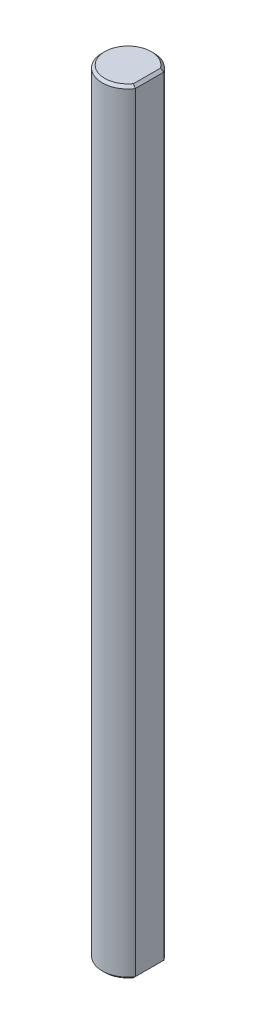
ISO-10303-21;
HEADER;
FILE_DESCRIPTION(('STEP AP214'),'2;1');
FILE_NAME('part.step','',(''),(''),'','','');
FILE_SCHEMA(('AUTOMOTIVE_DESIGN { 1 0 10303 214 1 1 1 1 }'));
ENDSEC;
DATA;
#1=APPLICATION_CONTEXT('core data for automotive mechanical design processes');
#2=APPLICATION_PROTOCOL_DEFINITION('international standard','automotive_design',2000,#1);
#3=PRODUCT_CONTEXT('',#1,'mechanical');
#4=PRODUCT('Part','Part','',(#3));
#5=PRODUCT_RELATED_PRODUCT_CATEGORY('part','',(#4));
#6=PRODUCT_DEFINITION_FORMATION('','',#4);
#7=PRODUCT_DEFINITION_CONTEXT('part definition',#1,'design');
#8=PRODUCT_DEFINITION('design','',#6,#7);
#9=PRODUCT_DEFINITION_SHAPE('','',#8);
#10=(LENGTH_UNIT() NAMED_UNIT(*) SI_UNIT(.MILLI.,.METRE.));
#11=(NAMED_UNIT(*) PLANE_ANGLE_UNIT() SI_UNIT($,.RADIAN.));
#12=(NAMED_UNIT(*) SI_UNIT($,.STERADIAN.) SOLID_ANGLE_UNIT());
#13=UNCERTAINTY_MEASURE_WITH_UNIT(LENGTH_MEASURE(1.E-05),#10,'distance_accuracy_value','');
#14=(GEOMETRIC_REPRESENTATION_CONTEXT(3) GLOBAL_UNCERTAINTY_ASSIGNED_CONTEXT((#13)) GLOBAL_UNIT_ASSIGNED_CONTEXT((#10,
#11,#12)) REPRESENTATION_CONTEXT('',''));
#15=CARTESIAN_POINT('',(0.,0.,0.));
#16=DIRECTION('',(0.,0.,1.));
#17=DIRECTION('',(1.,0.,0.));
#18=AXIS2_PLACEMENT_3D('',#15,#16,#17);
#19=CARTESIAN_POINT('',(0.,90.,0.));
#20=DIRECTION('',(0.,-1.,0.));
#21=DIRECTION('',(0.,0.,-1.));
#22=AXIS2_PLACEMENT_3D('',#19,#20,#21);
#23=CYLINDRICAL_SURFACE('',#22,3.);
#24=DIRECTION('',(0.,-1.,0.));
#25=VECTOR('',#24,1.);
#26=CARTESIAN_POINT('',(2.5,90.,-1.6583123951777));
#27=LINE('',#26,#25);
#28=CARTESIAN_POINT('',(2.5,89.7000000000001,-1.6583123951777));
#29=VERTEX_POINT('',#28);
#30=CARTESIAN_POINT('',(2.5,0.300000000000078,-1.6583123951777));
#31=VERTEX_POINT('',#30);
#32=EDGE_CURVE('E88',#29,#31,#27,.T.);
#33=ORIENTED_EDGE('',*,*,#32,.T.);
#34=CARTESIAN_POINT('',(0.,0.300000000000064,0.));
#35=DIRECTION('',(0.,1.,0.));
#36=DIRECTION('',(0.,0.,1.));
#37=AXIS2_PLACEMENT_3D('',#34,#35,#36);
#38=CIRCLE('',#37,3.);
#39=CARTESIAN_POINT('',(2.5,0.300000000000078,1.6583123951777));
#40=VERTEX_POINT('',#39);
#41=EDGE_CURVE('E93',#31,#40,#38,.T.);
#42=ORIENTED_EDGE('',*,*,#41,.T.);
#43=DIRECTION('',(0.,-1.,0.));
#44=VECTOR('',#43,1.);
#45=CARTESIAN_POINT('',(2.5,90.,1.6583123951777));
#46=LINE('',#45,#44);
#47=CARTESIAN_POINT('',(2.5,89.7000000000001,1.6583123951777));
#48=VERTEX_POINT('',#47);
#49=EDGE_CURVE('E90',#48,#40,#46,.T.);
#50=ORIENTED_EDGE('',*,*,#49,.F.);
#51=CARTESIAN_POINT('',(0.,89.7000000000001,0.));
#52=DIRECTION('',(0.,1.,0.));
#53=DIRECTION('',(0.,0.,1.));
#54=AXIS2_PLACEMENT_3D('',#51,#52,#53);
#55=CIRCLE('',#54,3.);
#56=EDGE_CURVE('E86',#48,#29,#55,.F.);
#57=ORIENTED_EDGE('',*,*,#56,.T.);
#58=EDGE_LOOP('',(#33,#42,#50,#57));
#59=FACE_BOUND('',#58,.T.);
#60=ADVANCED_FACE('F36',(#59),#23,.T.);
#61=CARTESIAN_POINT('',(2.5,90.,-1.6583123951777));
#62=DIRECTION('',(-1.,0.,0.));
#63=DIRECTION('',(0.,0.,1.));
#64=AXIS2_PLACEMENT_3D('',#61,#62,#63);
#65=PLANE('',#64);
#66=ORIENTED_EDGE('',*,*,#49,.T.);
#67=DIRECTION('',(0.,0.,-1.));
#68=VECTOR('',#67,1.);
#69=CARTESIAN_POINT('',(2.5,0.30000000000005,-1.6583123951777));
#70=LINE('',#69,#68);
#71=EDGE_CURVE('E101',#40,#31,#70,.T.);
#72=ORIENTED_EDGE('',*,*,#71,.T.);
#73=ORIENTED_EDGE('',*,*,#32,.F.);
#74=DIRECTION('',(0.,0.,1.));
#75=VECTOR('',#74,1.);
#76=CARTESIAN_POINT('',(2.5,89.7000000000001,1.6583123951777));
#77=LINE('',#76,#75);
#78=EDGE_CURVE('E99',#29,#48,#77,.T.);
#79=ORIENTED_EDGE('',*,*,#78,.T.);
#80=EDGE_LOOP('',(#66,#72,#73,#79));
#81=FACE_BOUND('',#80,.T.);
#82=ADVANCED_FACE('F98',(#81),#65,.F.);
#83=CARTESIAN_POINT('',(0.,90.,0.));
#84=DIRECTION('',(0.,1.,0.));
#85=DIRECTION('',(0.,0.,1.));
#86=AXIS2_PLACEMENT_3D('',#83,#84,#85);
#87=PLANE('',#86);
#88=CARTESIAN_POINT('',(0.,90.,0.));
#89=DIRECTION('',(0.,1.,0.));
#90=DIRECTION('',(0.,0.,1.));
#91=AXIS2_PLACEMENT_3D('',#88,#89,#90);
#92=CIRCLE('',#91,2.70000000000005);
#93=CARTESIAN_POINT('',(2.19999999999984,90.,-1.56524758425016));
#94=VERTEX_POINT('',#93);
#95=CARTESIAN_POINT('',(2.19999999999984,90.,1.56524758425016));
#96=VERTEX_POINT('',#95);
#97=EDGE_CURVE('E51',#94,#96,#92,.T.);
#98=ORIENTED_EDGE('',*,*,#97,.T.);
#99=DIRECTION('',(0.,0.,-1.));
#100=VECTOR('',#99,1.);
#101=CARTESIAN_POINT('',(2.20000000000005,90.,-1.6583123951777));
#102=LINE('',#101,#100);
#103=EDGE_CURVE('E11',#96,#94,#102,.T.);
#104=ORIENTED_EDGE('',*,*,#103,.T.);
#105=EDGE_LOOP('',(#98,#104));
#106=FACE_BOUND('',#105,.T.);
#107=ADVANCED_FACE('F158',(#106),#87,.T.);
#108=CARTESIAN_POINT('',(0.,0.,0.));
#109=DIRECTION('',(0.,1.,0.));
#110=DIRECTION('',(0.,0.,1.));
#111=AXIS2_PLACEMENT_3D('',#108,#109,#110);
#112=PLANE('',#111);
#113=CARTESIAN_POINT('',(0.,0.,0.));
#114=DIRECTION('',(0.,1.,0.));
#115=DIRECTION('',(0.,0.,1.));
#116=AXIS2_PLACEMENT_3D('',#113,#114,#115);
#117=CIRCLE('',#116,2.69999999999995);
#118=CARTESIAN_POINT('',(2.19999999999974,0.,1.56524758425013));
#119=VERTEX_POINT('',#118);
#120=CARTESIAN_POINT('',(2.19999999999974,0.,-1.56524758425013));
#121=VERTEX_POINT('',#120);
#122=EDGE_CURVE('E146',#119,#121,#117,.F.);
#123=ORIENTED_EDGE('',*,*,#122,.T.);
#124=DIRECTION('',(0.,0.,1.));
#125=VECTOR('',#124,1.);
#126=CARTESIAN_POINT('',(2.19999999999995,0.,0.));
#127=LINE('',#126,#125);
#128=EDGE_CURVE('E94',#121,#119,#127,.T.);
#129=ORIENTED_EDGE('',*,*,#128,.T.);
#130=EDGE_LOOP('',(#123,#129));
#131=FACE_BOUND('',#130,.T.);
#132=ADVANCED_FACE('F156',(#131),#112,.F.);
#133=CARTESIAN_POINT('',(0.,0.30000000000005,0.));
#134=DIRECTION('',(0.,1.,0.));
#135=DIRECTION('',(0.,0.,1.));
#136=AXIS2_PLACEMENT_3D('',#133,#134,#135);
#137=CONICAL_SURFACE('',#136,3.,0.785398163397444);
#138=CARTESIAN_POINT('',(2.5,0.30000000000005,-1.6583123951777));
#139=CARTESIAN_POINT('',(2.44993376791129,0.249933767911336,-1.64322876187384));
#140=CARTESIAN_POINT('',(2.39990066385969,0.199900663859741,-1.62793154813919));
#141=CARTESIAN_POINT('',(2.29990066379602,0.0999006637960638,-1.59690994490714));
#142=CARTESIAN_POINT('',(2.24993376784759,0.0499337678476331,-1.58118555499938));
#143=CARTESIAN_POINT('',(2.19999999999993,0.,-1.56524758425045));
#144=B_SPLINE_CURVE_WITH_KNOTS('',3,(#138,#139,#140,#141,#142,#143),.UNSPECIFIED.,.F.,.F.,(4,2,
4),(0.,0.217176540517321,0.434353289675063),.UNSPECIFIED.);
#145=EDGE_CURVE('E106',#121,#31,#144,.F.);
#146=ORIENTED_EDGE('',*,*,#145,.F.);
#147=ORIENTED_EDGE('',*,*,#122,.F.);
#148=CARTESIAN_POINT('',(2.19999999999995,0.,1.56524758425028));
#149=CARTESIAN_POINT('',(2.24993376784761,0.049933767847663,1.58118555499918));
#150=CARTESIAN_POINT('',(2.29990066379604,0.0999006637960846,1.59690994490699));
#151=CARTESIAN_POINT('',(2.39990066385967,0.199900663859716,1.62793154813933));
#152=CARTESIAN_POINT('',(2.44993376791122,0.249933767911274,1.64322876187422));
#153=CARTESIAN_POINT('',(2.49999999999989,0.299999999999939,1.6583123951784));
#154=B_SPLINE_CURVE_WITH_KNOTS('',3,(#148,#149,#150,#151,#152,#153),.UNSPECIFIED.,.F.,.F.,(4,2,
4),(0.,0.217176749157741,0.434353289675058),.UNSPECIFIED.);
#155=EDGE_CURVE('E102',#40,#119,#154,.F.);
#156=ORIENTED_EDGE('',*,*,#155,.F.);
#157=ORIENTED_EDGE('',*,*,#41,.F.);
#158=EDGE_LOOP('',(#146,#147,#156,#157));
#159=FACE_BOUND('',#158,.T.);
#160=ADVANCED_FACE('F132',(#159),#137,.T.);
#161=CARTESIAN_POINT('',(2.5,0.30000000000005,-1.6583123951777));
#162=DIRECTION('',(-0.707106781186551,0.707106781186544,0.));
#163=DIRECTION('',(0.,0.,-1.));
#164=AXIS2_PLACEMENT_3D('',#161,#162,#163);
#165=PLANE('',#164);
#166=ORIENTED_EDGE('',*,*,#155,.T.);
#167=ORIENTED_EDGE('',*,*,#128,.F.);
#168=ORIENTED_EDGE('',*,*,#145,.T.);
#169=ORIENTED_EDGE('',*,*,#71,.F.);
#170=EDGE_LOOP('',(#166,#167,#168,#169));
#171=FACE_BOUND('',#170,.T.);
#172=ADVANCED_FACE('F124',(#171),#165,.F.);
#173=CARTESIAN_POINT('',(0.,90.,0.));
#174=DIRECTION('',(0.,-1.,0.));
#175=DIRECTION('',(0.,0.,-1.));
#176=AXIS2_PLACEMENT_3D('',#173,#174,#175);
#177=CONICAL_SURFACE('',#176,2.70000000000005,0.785398163397468);
#178=CARTESIAN_POINT('',(2.20000000000005,90.,-1.56524758425031));
#179=CARTESIAN_POINT('',(2.2499337678477,89.9500662321524,-1.5811855549992));
#180=CARTESIAN_POINT('',(2.2999006637961,89.900099336204,-1.59690994490701));
#181=CARTESIAN_POINT('',(2.3999006638597,89.8000993361404,-1.62793154813934));
#182=CARTESIAN_POINT('',(2.44993376791124,89.7500662320888,-1.64322876187422));
#183=CARTESIAN_POINT('',(2.49999999999989,89.7000000000002,-1.6583123951784));
#184=B_SPLINE_CURVE_WITH_KNOTS('',3,(#178,#179,#180,#181,#182,#183),.UNSPECIFIED.,.F.,.F.,(4,2,
4),(0.,0.217176749157665,0.434353289674909),.UNSPECIFIED.);
#185=EDGE_CURVE('E64',#29,#94,#184,.F.);
#186=ORIENTED_EDGE('',*,*,#185,.F.);
#187=ORIENTED_EDGE('',*,*,#56,.F.);
#188=CARTESIAN_POINT('',(2.5,89.7000000000001,1.6583123951777));
#189=CARTESIAN_POINT('',(2.4499337679113,89.7500662320888,1.64322876187385));
#190=CARTESIAN_POINT('',(2.39990066385972,89.8000993361403,1.6279315481392));
#191=CARTESIAN_POINT('',(2.29990066379608,89.900099336204,1.59690994490716));
#192=CARTESIAN_POINT('',(2.24993376784767,89.9500662321524,1.5811855549994));
#193=CARTESIAN_POINT('',(2.20000000000002,90.,1.56524758425048));
#194=B_SPLINE_CURVE_WITH_KNOTS('',3,(#188,#189,#190,#191,#192,#193),.UNSPECIFIED.,.F.,.F.,(4,2,
4),(0.,0.21717654051725,0.434353289674915),.UNSPECIFIED.);
#195=EDGE_CURVE('E42',#96,#48,#194,.F.);
#196=ORIENTED_EDGE('',*,*,#195,.F.);
#197=ORIENTED_EDGE('',*,*,#97,.F.);
#198=EDGE_LOOP('',(#186,#187,#196,#197));
#199=FACE_BOUND('',#198,.T.);
#200=ADVANCED_FACE('F105',(#199),#177,.T.);
#201=CARTESIAN_POINT('',(2.20000000000005,90.,0.));
#202=DIRECTION('',(0.707106781186534,0.707106781186561,0.));
#203=DIRECTION('',(0.,0.,1.));
#204=AXIS2_PLACEMENT_3D('',#201,#202,#203);
#205=PLANE('',#204);
#206=ORIENTED_EDGE('',*,*,#195,.T.);
#207=ORIENTED_EDGE('',*,*,#78,.F.);
#208=ORIENTED_EDGE('',*,*,#185,.T.);
#209=ORIENTED_EDGE('',*,*,#103,.F.);
#210=EDGE_LOOP('',(#206,#207,#208,#209));
#211=FACE_BOUND('',#210,.T.);
#212=ADVANCED_FACE('F39',(#211),#205,.T.);
#213=CLOSED_SHELL('',(#60,#82,#107,#132,#160,#172,#200,#212));
#214=MANIFOLD_SOLID_BREP('B2',#213);
#215=ADVANCED_BREP_SHAPE_REPRESENTATION('',(#18,#214),#14);
#216=SHAPE_DEFINITION_REPRESENTATION(#9,#215);
ENDSEC;
END-ISO-10303-21;
